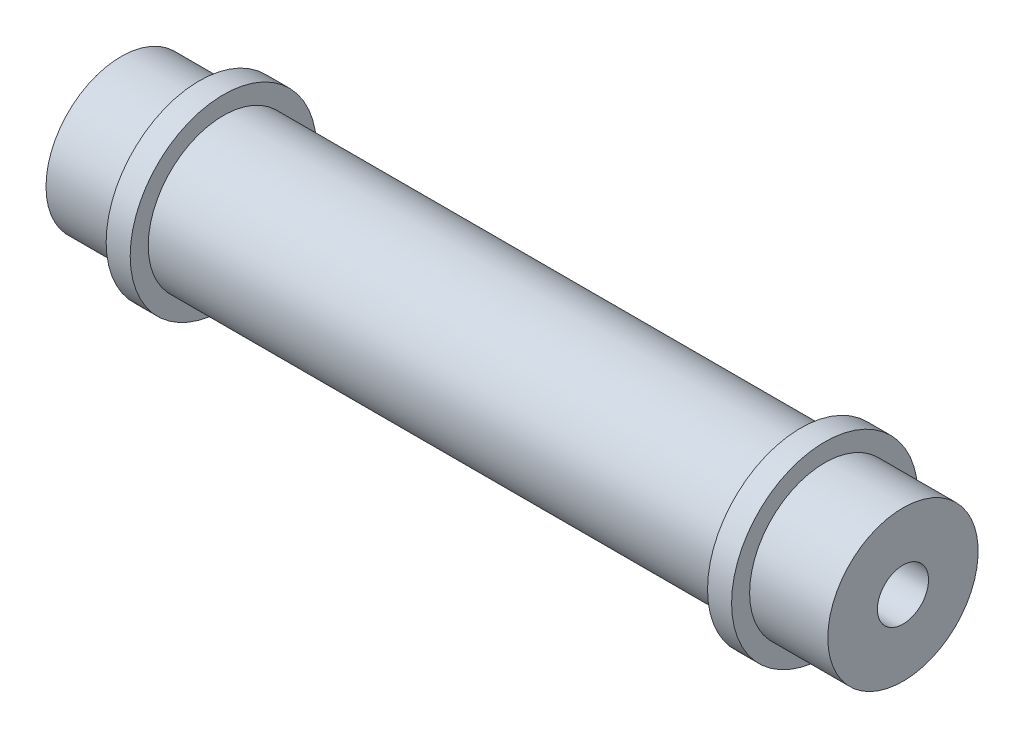
ISO-10303-21;
HEADER;
FILE_DESCRIPTION(('STEP AP214'),'2;1');
FILE_NAME('part.step','',(''),(''),'','','');
FILE_SCHEMA(('AUTOMOTIVE_DESIGN { 1 0 10303 214 1 1 1 1 }'));
ENDSEC;
DATA;
#1=APPLICATION_CONTEXT('core data for automotive mechanical design processes');
#2=APPLICATION_PROTOCOL_DEFINITION('international standard','automotive_design',2000,#1);
#3=PRODUCT_CONTEXT('',#1,'mechanical');
#4=PRODUCT('Part','Part','',(#3));
#5=PRODUCT_RELATED_PRODUCT_CATEGORY('part','',(#4));
#6=PRODUCT_DEFINITION_FORMATION('','',#4);
#7=PRODUCT_DEFINITION_CONTEXT('part definition',#1,'design');
#8=PRODUCT_DEFINITION('design','',#6,#7);
#9=PRODUCT_DEFINITION_SHAPE('','',#8);
#10=(LENGTH_UNIT() NAMED_UNIT(*) SI_UNIT(.MILLI.,.METRE.));
#11=(NAMED_UNIT(*) PLANE_ANGLE_UNIT() SI_UNIT($,.RADIAN.));
#12=(NAMED_UNIT(*) SI_UNIT($,.STERADIAN.) SOLID_ANGLE_UNIT());
#13=UNCERTAINTY_MEASURE_WITH_UNIT(LENGTH_MEASURE(1.E-05),#10,'distance_accuracy_value','');
#14=(GEOMETRIC_REPRESENTATION_CONTEXT(3) GLOBAL_UNCERTAINTY_ASSIGNED_CONTEXT((#13)) GLOBAL_UNIT_ASSIGNED_CONTEXT((#10,
#11,#12)) REPRESENTATION_CONTEXT('',''));
#15=CARTESIAN_POINT('',(0.,0.,0.));
#16=DIRECTION('',(0.,0.,1.));
#17=DIRECTION('',(1.,0.,0.));
#18=AXIS2_PLACEMENT_3D('',#15,#16,#17);
#19=CARTESIAN_POINT('',(-1000.,0.,0.));
#20=DIRECTION('',(-1.,0.,0.));
#21=DIRECTION('',(0.,0.,1.));
#22=AXIS2_PLACEMENT_3D('',#19,#20,#21);
#23=CYLINDRICAL_SURFACE('',#22,12.5);
#24=CARTESIAN_POINT('',(48.,0.,0.));
#25=DIRECTION('',(-1.,0.,0.));
#26=DIRECTION('',(0.,0.,1.));
#27=AXIS2_PLACEMENT_3D('',#24,#25,#26);
#28=CIRCLE('',#27,12.5);
#29=CARTESIAN_POINT('',(48.,0.,12.5));
#30=VERTEX_POINT('',#29);
#31=EDGE_CURVE('E11',#30,#30,#28,.T.);
#32=ORIENTED_EDGE('',*,*,#31,.T.);
#33=EDGE_LOOP('',(#32));
#34=FACE_BOUND('',#33,.T.);
#35=CARTESIAN_POINT('',(-48.,0.,0.));
#36=DIRECTION('',(-1.,0.,0.));
#37=DIRECTION('',(0.,0.,1.));
#38=AXIS2_PLACEMENT_3D('',#35,#36,#37);
#39=CIRCLE('',#38,12.5);
#40=CARTESIAN_POINT('',(-48.,0.,12.5));
#41=VERTEX_POINT('',#40);
#42=EDGE_CURVE('E78',#41,#41,#39,.T.);
#43=ORIENTED_EDGE('',*,*,#42,.F.);
#44=EDGE_LOOP('',(#43));
#45=FACE_BOUND('',#44,.T.);
#46=ADVANCED_FACE('F38',(#34,#45),#23,.T.);
#47=CARTESIAN_POINT('',(48.0000000000001,12.5,0.));
#48=DIRECTION('',(1.,0.,0.));
#49=DIRECTION('',(0.,0.,-1.));
#50=AXIS2_PLACEMENT_3D('',#47,#48,#49);
#51=PLANE('',#50);
#52=ORIENTED_EDGE('',*,*,#31,.F.);
#53=EDGE_LOOP('',(#52));
#54=FACE_BOUND('',#53,.T.);
#55=CARTESIAN_POINT('',(48.,0.,0.));
#56=DIRECTION('',(-1.,0.,0.));
#57=DIRECTION('',(0.,0.,1.));
#58=AXIS2_PLACEMENT_3D('',#55,#56,#57);
#59=CIRCLE('',#58,15.5);
#60=CARTESIAN_POINT('',(48.,0.,15.5));
#61=VERTEX_POINT('',#60);
#62=EDGE_CURVE('E45',#61,#61,#59,.T.);
#63=ORIENTED_EDGE('',*,*,#62,.T.);
#64=EDGE_LOOP('',(#63));
#65=FACE_BOUND('',#64,.T.);
#66=ADVANCED_FACE('F98',(#54,#65),#51,.F.);
#67=CARTESIAN_POINT('',(-1000.,0.,0.));
#68=DIRECTION('',(-1.,0.,0.));
#69=DIRECTION('',(0.,0.,1.));
#70=AXIS2_PLACEMENT_3D('',#67,#68,#69);
#71=CYLINDRICAL_SURFACE('',#70,15.5);
#72=ORIENTED_EDGE('',*,*,#62,.F.);
#73=EDGE_LOOP('',(#72));
#74=FACE_BOUND('',#73,.T.);
#75=CARTESIAN_POINT('',(52.,0.,0.));
#76=DIRECTION('',(-1.,0.,0.));
#77=DIRECTION('',(0.,0.,1.));
#78=AXIS2_PLACEMENT_3D('',#75,#76,#77);
#79=CIRCLE('',#78,15.5);
#80=CARTESIAN_POINT('',(52.,0.,15.5));
#81=VERTEX_POINT('',#80);
#82=EDGE_CURVE('E93',#81,#81,#79,.T.);
#83=ORIENTED_EDGE('',*,*,#82,.T.);
#84=EDGE_LOOP('',(#83));
#85=FACE_BOUND('',#84,.T.);
#86=ADVANCED_FACE('F100',(#74,#85),#71,.T.);
#87=CARTESIAN_POINT('',(52.0000000000001,15.5,0.));
#88=DIRECTION('',(-1.,0.,0.));
#89=DIRECTION('',(0.,0.,1.));
#90=AXIS2_PLACEMENT_3D('',#87,#88,#89);
#91=PLANE('',#90);
#92=ORIENTED_EDGE('',*,*,#82,.F.);
#93=EDGE_LOOP('',(#92));
#94=FACE_BOUND('',#93,.T.);
#95=CARTESIAN_POINT('',(52.,0.,0.));
#96=DIRECTION('',(-1.,0.,0.));
#97=DIRECTION('',(0.,0.,1.));
#98=AXIS2_PLACEMENT_3D('',#95,#96,#97);
#99=CIRCLE('',#98,12.5);
#100=CARTESIAN_POINT('',(52.,0.,12.5));
#101=VERTEX_POINT('',#100);
#102=EDGE_CURVE('E90',#101,#101,#99,.T.);
#103=ORIENTED_EDGE('',*,*,#102,.T.);
#104=EDGE_LOOP('',(#103));
#105=FACE_BOUND('',#104,.T.);
#106=ADVANCED_FACE('F103',(#94,#105),#91,.F.);
#107=CARTESIAN_POINT('',(-1000.,0.,0.));
#108=DIRECTION('',(-1.,0.,0.));
#109=DIRECTION('',(0.,0.,1.));
#110=AXIS2_PLACEMENT_3D('',#107,#108,#109);
#111=CYLINDRICAL_SURFACE('',#110,12.5);
#112=ORIENTED_EDGE('',*,*,#102,.F.);
#113=EDGE_LOOP('',(#112));
#114=FACE_BOUND('',#113,.T.);
#115=CARTESIAN_POINT('',(65.0000000000002,0.,0.));
#116=DIRECTION('',(-1.,0.,0.));
#117=DIRECTION('',(0.,0.,1.));
#118=AXIS2_PLACEMENT_3D('',#115,#116,#117);
#119=CIRCLE('',#118,12.5);
#120=CARTESIAN_POINT('',(65.0000000000002,0.,12.5));
#121=VERTEX_POINT('',#120);
#122=EDGE_CURVE('E87',#121,#121,#119,.T.);
#123=ORIENTED_EDGE('',*,*,#122,.T.);
#124=EDGE_LOOP('',(#123));
#125=FACE_BOUND('',#124,.T.);
#126=ADVANCED_FACE('F109',(#114,#125),#111,.T.);
#127=CARTESIAN_POINT('',(65.0000000000001,12.5,0.));
#128=DIRECTION('',(-1.,0.,0.));
#129=DIRECTION('',(0.,0.,1.));
#130=AXIS2_PLACEMENT_3D('',#127,#128,#129);
#131=PLANE('',#130);
#132=CARTESIAN_POINT('',(65.0000000000001,0.,0.));
#133=DIRECTION('',(1.,0.,0.));
#134=DIRECTION('',(0.,0.,-1.));
#135=AXIS2_PLACEMENT_3D('',#132,#133,#134);
#136=CIRCLE('',#135,4.25);
#137=CARTESIAN_POINT('',(65.0000000000001,0.,-4.25));
#138=VERTEX_POINT('',#137);
#139=EDGE_CURVE('E81',#138,#138,#136,.T.);
#140=ORIENTED_EDGE('',*,*,#139,.F.);
#141=EDGE_LOOP('',(#140));
#142=FACE_BOUND('',#141,.T.);
#143=ORIENTED_EDGE('',*,*,#122,.F.);
#144=EDGE_LOOP('',(#143));
#145=FACE_BOUND('',#144,.T.);
#146=ADVANCED_FACE('F115',(#142,#145),#131,.F.);
#147=CARTESIAN_POINT('',(42.5000000000001,0.,0.));
#148=DIRECTION('',(1.,0.,0.));
#149=DIRECTION('',(0.,0.,-1.));
#150=AXIS2_PLACEMENT_3D('',#147,#148,#149);
#151=CONICAL_SURFACE('',#150,4.24999999999999,1.02974425867665);
#152=CARTESIAN_POINT('',(39.946342369133,0.,0.));
#153=VERTEX_POINT('',#152);
#154=VERTEX_LOOP('',#153);
#155=FACE_BOUND('',#154,.T.);
#156=CARTESIAN_POINT('',(42.5000000000001,0.,0.));
#157=DIRECTION('',(1.,0.,0.));
#158=DIRECTION('',(0.,0.,-1.));
#159=AXIS2_PLACEMENT_3D('',#156,#157,#158);
#160=CIRCLE('',#159,4.24999999999999);
#161=CARTESIAN_POINT('',(42.5000000000001,0.,-4.24999999999999));
#162=VERTEX_POINT('',#161);
#163=EDGE_CURVE('E84',#162,#162,#160,.T.);
#164=ORIENTED_EDGE('',*,*,#163,.T.);
#165=EDGE_LOOP('',(#164));
#166=FACE_BOUND('',#165,.T.);
#167=ADVANCED_FACE('F120',(#155,#166),#151,.F.);
#168=CARTESIAN_POINT('',(65.0000000000001,0.,0.));
#169=DIRECTION('',(1.,0.,0.));
#170=DIRECTION('',(0.,0.,-1.));
#171=AXIS2_PLACEMENT_3D('',#168,#169,#170);
#172=CYLINDRICAL_SURFACE('',#171,4.25);
#173=ORIENTED_EDGE('',*,*,#163,.F.);
#174=EDGE_LOOP('',(#173));
#175=FACE_BOUND('',#174,.T.);
#176=ORIENTED_EDGE('',*,*,#139,.T.);
#177=EDGE_LOOP('',(#176));
#178=FACE_BOUND('',#177,.T.);
#179=ADVANCED_FACE('F126',(#175,#178),#172,.F.);
#180=CARTESIAN_POINT('',(-48.0000000000001,12.5,0.));
#181=DIRECTION('',(-1.,0.,0.));
#182=DIRECTION('',(0.,0.,-1.));
#183=AXIS2_PLACEMENT_3D('',#180,#181,#182);
#184=PLANE('',#183);
#185=ORIENTED_EDGE('',*,*,#42,.T.);
#186=EDGE_LOOP('',(#185));
#187=FACE_BOUND('',#186,.T.);
#188=CARTESIAN_POINT('',(-48.,0.,0.));
#189=DIRECTION('',(-1.,0.,0.));
#190=DIRECTION('',(0.,0.,1.));
#191=AXIS2_PLACEMENT_3D('',#188,#189,#190);
#192=CIRCLE('',#191,15.5);
#193=CARTESIAN_POINT('',(-48.,0.,15.5));
#194=VERTEX_POINT('',#193);
#195=EDGE_CURVE('E75',#194,#194,#192,.T.);
#196=ORIENTED_EDGE('',*,*,#195,.F.);
#197=EDGE_LOOP('',(#196));
#198=FACE_BOUND('',#197,.T.);
#199=ADVANCED_FACE('F139',(#187,#198),#184,.F.);
#200=CARTESIAN_POINT('',(1000.,0.,0.));
#201=DIRECTION('',(1.,0.,0.));
#202=DIRECTION('',(0.,0.,1.));
#203=AXIS2_PLACEMENT_3D('',#200,#201,#202);
#204=CYLINDRICAL_SURFACE('',#203,15.5);
#205=ORIENTED_EDGE('',*,*,#195,.T.);
#206=EDGE_LOOP('',(#205));
#207=FACE_BOUND('',#206,.T.);
#208=CARTESIAN_POINT('',(-52.,0.,0.));
#209=DIRECTION('',(-1.,0.,0.));
#210=DIRECTION('',(0.,0.,1.));
#211=AXIS2_PLACEMENT_3D('',#208,#209,#210);
#212=CIRCLE('',#211,15.5);
#213=CARTESIAN_POINT('',(-52.,0.,15.5));
#214=VERTEX_POINT('',#213);
#215=EDGE_CURVE('E72',#214,#214,#212,.T.);
#216=ORIENTED_EDGE('',*,*,#215,.F.);
#217=EDGE_LOOP('',(#216));
#218=FACE_BOUND('',#217,.T.);
#219=ADVANCED_FACE('F142',(#207,#218),#204,.T.);
#220=CARTESIAN_POINT('',(-52.0000000000001,15.5,0.));
#221=DIRECTION('',(1.,0.,0.));
#222=DIRECTION('',(0.,0.,1.));
#223=AXIS2_PLACEMENT_3D('',#220,#221,#222);
#224=PLANE('',#223);
#225=ORIENTED_EDGE('',*,*,#215,.T.);
#226=EDGE_LOOP('',(#225));
#227=FACE_BOUND('',#226,.T.);
#228=CARTESIAN_POINT('',(-52.,0.,0.));
#229=DIRECTION('',(-1.,0.,0.));
#230=DIRECTION('',(0.,0.,1.));
#231=AXIS2_PLACEMENT_3D('',#228,#229,#230);
#232=CIRCLE('',#231,12.5);
#233=CARTESIAN_POINT('',(-52.,0.,12.5));
#234=VERTEX_POINT('',#233);
#235=EDGE_CURVE('E65',#234,#234,#232,.T.);
#236=ORIENTED_EDGE('',*,*,#235,.F.);
#237=EDGE_LOOP('',(#236));
#238=FACE_BOUND('',#237,.T.);
#239=ADVANCED_FACE('F148',(#227,#238),#224,.F.);
#240=CARTESIAN_POINT('',(1000.,0.,0.));
#241=DIRECTION('',(1.,0.,0.));
#242=DIRECTION('',(0.,0.,1.));
#243=AXIS2_PLACEMENT_3D('',#240,#241,#242);
#244=CYLINDRICAL_SURFACE('',#243,12.5);
#245=ORIENTED_EDGE('',*,*,#235,.T.);
#246=EDGE_LOOP('',(#245));
#247=FACE_BOUND('',#246,.T.);
#248=CARTESIAN_POINT('',(-65.0000000000002,0.,0.));
#249=DIRECTION('',(-1.,0.,0.));
#250=DIRECTION('',(0.,0.,1.));
#251=AXIS2_PLACEMENT_3D('',#248,#249,#250);
#252=CIRCLE('',#251,12.5);
#253=CARTESIAN_POINT('',(-65.0000000000002,0.,12.5));
#254=VERTEX_POINT('',#253);
#255=EDGE_CURVE('E61',#254,#254,#252,.T.);
#256=ORIENTED_EDGE('',*,*,#255,.F.);
#257=EDGE_LOOP('',(#256));
#258=FACE_BOUND('',#257,.T.);
#259=ADVANCED_FACE('F154',(#247,#258),#244,.T.);
#260=CARTESIAN_POINT('',(-65.0000000000001,12.5,0.));
#261=DIRECTION('',(1.,0.,0.));
#262=DIRECTION('',(0.,0.,1.));
#263=AXIS2_PLACEMENT_3D('',#260,#261,#262);
#264=PLANE('',#263);
#265=CARTESIAN_POINT('',(-65.0000000000001,0.,0.));
#266=DIRECTION('',(1.,0.,0.));
#267=DIRECTION('',(0.,0.,-1.));
#268=AXIS2_PLACEMENT_3D('',#265,#266,#267);
#269=CIRCLE('',#268,4.25);
#270=CARTESIAN_POINT('',(-65.0000000000001,0.,-4.25));
#271=VERTEX_POINT('',#270);
#272=EDGE_CURVE('E62',#271,#271,#269,.T.);
#273=ORIENTED_EDGE('',*,*,#272,.T.);
#274=EDGE_LOOP('',(#273));
#275=FACE_BOUND('',#274,.T.);
#276=ORIENTED_EDGE('',*,*,#255,.T.);
#277=EDGE_LOOP('',(#276));
#278=FACE_BOUND('',#277,.T.);
#279=ADVANCED_FACE('F55',(#275,#278),#264,.F.);
#280=CARTESIAN_POINT('',(-42.5000000000001,0.,0.));
#281=DIRECTION('',(-1.,0.,0.));
#282=DIRECTION('',(0.,0.,-1.));
#283=AXIS2_PLACEMENT_3D('',#280,#281,#282);
#284=CONICAL_SURFACE('',#283,4.24999999999999,1.02974425867665);
#285=CARTESIAN_POINT('',(-39.946342369133,0.,0.));
#286=VERTEX_POINT('',#285);
#287=VERTEX_LOOP('',#286);
#288=FACE_BOUND('',#287,.T.);
#289=CARTESIAN_POINT('',(-42.5000000000001,0.,0.));
#290=DIRECTION('',(1.,0.,0.));
#291=DIRECTION('',(0.,0.,-1.));
#292=AXIS2_PLACEMENT_3D('',#289,#290,#291);
#293=CIRCLE('',#292,4.24999999999999);
#294=CARTESIAN_POINT('',(-42.5000000000001,0.,-4.24999999999999));
#295=VERTEX_POINT('',#294);
#296=EDGE_CURVE('E59',#295,#295,#293,.T.);
#297=ORIENTED_EDGE('',*,*,#296,.F.);
#298=EDGE_LOOP('',(#297));
#299=FACE_BOUND('',#298,.T.);
#300=ADVANCED_FACE('F51',(#288,#299),#284,.F.);
#301=CARTESIAN_POINT('',(-65.0000000000001,0.,0.));
#302=DIRECTION('',(-1.,0.,0.));
#303=DIRECTION('',(0.,0.,-1.));
#304=AXIS2_PLACEMENT_3D('',#301,#302,#303);
#305=CYLINDRICAL_SURFACE('',#304,4.25);
#306=ORIENTED_EDGE('',*,*,#296,.T.);
#307=EDGE_LOOP('',(#306));
#308=FACE_BOUND('',#307,.T.);
#309=ORIENTED_EDGE('',*,*,#272,.F.);
#310=EDGE_LOOP('',(#309));
#311=FACE_BOUND('',#310,.T.);
#312=ADVANCED_FACE('F54',(#308,#311),#305,.F.);
#313=CLOSED_SHELL('',(#46,#66,#86,#106,#126,#146,#167,#179,#199,#219,#239,#259,#279,#300,#312));
#314=MANIFOLD_SOLID_BREP('B2',#313);
#315=ADVANCED_BREP_SHAPE_REPRESENTATION('',(#18,#314),#14);
#316=SHAPE_DEFINITION_REPRESENTATION(#9,#315);
ENDSEC;
END-ISO-10303-21;
